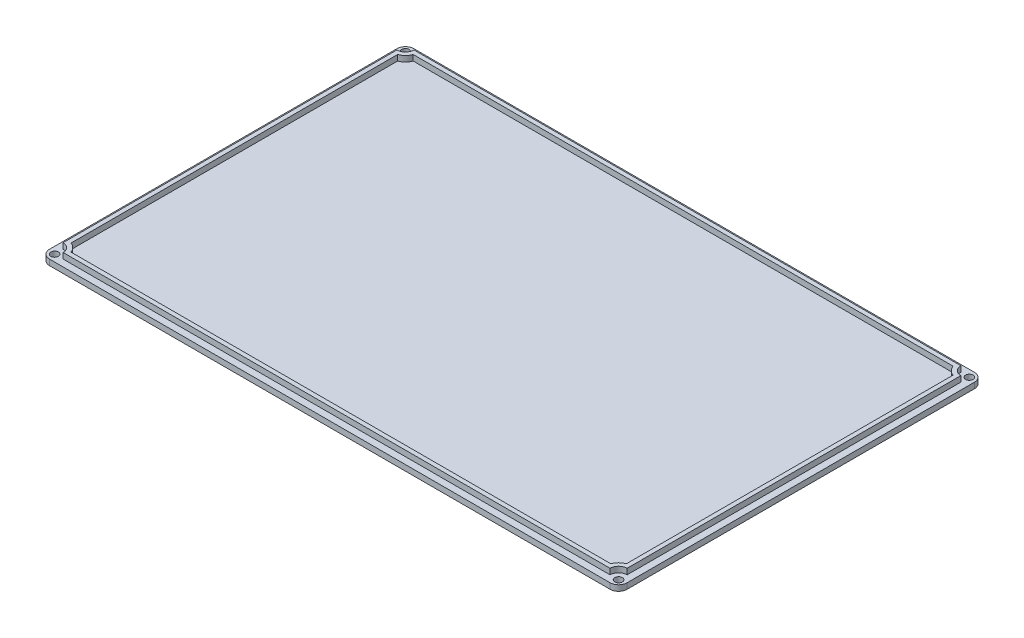
ISO-10303-21;
HEADER;
FILE_DESCRIPTION(('STEP AP214'),'2;1');
FILE_NAME('part.step','',(''),(''),'','','');
FILE_SCHEMA(('AUTOMOTIVE_DESIGN { 1 0 10303 214 1 1 1 1 }'));
ENDSEC;
DATA;
#1=APPLICATION_CONTEXT('core data for automotive mechanical design processes');
#2=APPLICATION_PROTOCOL_DEFINITION('international standard','automotive_design',2000,#1);
#3=PRODUCT_CONTEXT('',#1,'mechanical');
#4=PRODUCT('Part','Part','',(#3));
#5=PRODUCT_RELATED_PRODUCT_CATEGORY('part','',(#4));
#6=PRODUCT_DEFINITION_FORMATION('','',#4);
#7=PRODUCT_DEFINITION_CONTEXT('part definition',#1,'design');
#8=PRODUCT_DEFINITION('design','',#6,#7);
#9=PRODUCT_DEFINITION_SHAPE('','',#8);
#10=(LENGTH_UNIT() NAMED_UNIT(*) SI_UNIT(.MILLI.,.METRE.));
#11=(NAMED_UNIT(*) PLANE_ANGLE_UNIT() SI_UNIT($,.RADIAN.));
#12=(NAMED_UNIT(*) SI_UNIT($,.STERADIAN.) SOLID_ANGLE_UNIT());
#13=UNCERTAINTY_MEASURE_WITH_UNIT(LENGTH_MEASURE(1.E-05),#10,'distance_accuracy_value','');
#14=(GEOMETRIC_REPRESENTATION_CONTEXT(3) GLOBAL_UNCERTAINTY_ASSIGNED_CONTEXT((#13)) GLOBAL_UNIT_ASSIGNED_CONTEXT((#10,
#11,#12)) REPRESENTATION_CONTEXT('',''));
#15=CARTESIAN_POINT('',(0.,0.,0.));
#16=DIRECTION('',(0.,0.,1.));
#17=DIRECTION('',(1.,0.,0.));
#18=AXIS2_PLACEMENT_3D('',#15,#16,#17);
#19=CARTESIAN_POINT('',(-2.,-1.699999902,-128.3359932));
#20=DIRECTION('',(0.,0.,1.));
#21=DIRECTION('',(1.,0.,0.));
#22=AXIS2_PLACEMENT_3D('',#19,#20,#21);
#23=PLANE('',#22);
#24=DIRECTION('',(1.,0.,0.));
#25=VECTOR('',#24,1.);
#26=CARTESIAN_POINT('',(-2.,-1.699999902,-128.3359932));
#27=LINE('',#26,#25);
#28=CARTESIAN_POINT('',(0.54,-1.699999902,-128.3359932));
#29=VERTEX_POINT('',#28);
#30=CARTESIAN_POINT('',(167.5159932,-1.699999902,-128.3359932));
#31=VERTEX_POINT('',#30);
#32=EDGE_CURVE('E451',#29,#31,#27,.T.);
#33=ORIENTED_EDGE('',*,*,#32,.F.);
#34=DIRECTION('',(0.,1.,0.));
#35=VECTOR('',#34,1.);
#36=CARTESIAN_POINT('',(0.54,0.,-128.3359932));
#37=LINE('',#36,#35);
#38=CARTESIAN_POINT('',(0.54,0.,-128.3359932));
#39=VERTEX_POINT('',#38);
#40=EDGE_CURVE('E519',#29,#39,#37,.T.);
#41=ORIENTED_EDGE('',*,*,#40,.T.);
#42=DIRECTION('',(1.,0.,0.));
#43=VECTOR('',#42,1.);
#44=CARTESIAN_POINT('',(-2.,0.,-128.3359932));
#45=LINE('',#44,#43);
#46=CARTESIAN_POINT('',(167.5159932,0.,-128.3359932));
#47=VERTEX_POINT('',#46);
#48=EDGE_CURVE('E426',#39,#47,#45,.T.);
#49=ORIENTED_EDGE('',*,*,#48,.T.);
#50=DIRECTION('',(0.,1.,0.));
#51=VECTOR('',#50,1.);
#52=CARTESIAN_POINT('',(167.5159932,-1.699999902,-128.3359932));
#53=LINE('',#52,#51);
#54=EDGE_CURVE('E516',#47,#31,#53,.F.);
#55=ORIENTED_EDGE('',*,*,#54,.T.);
#56=EDGE_LOOP('',(#33,#41,#49,#55));
#57=FACE_BOUND('',#56,.T.);
#58=ADVANCED_FACE('F101',(#57),#23,.F.);
#59=CARTESIAN_POINT('',(170.0559932,-1.699999902,-128.3359932));
#60=DIRECTION('',(-1.,0.,0.));
#61=DIRECTION('',(0.,0.,1.));
#62=AXIS2_PLACEMENT_3D('',#59,#60,#61);
#63=PLANE('',#62);
#64=DIRECTION('',(0.,0.,1.));
#65=VECTOR('',#64,1.);
#66=CARTESIAN_POINT('',(170.0559932,-1.699999902,-128.3359932));
#67=LINE('',#66,#65);
#68=CARTESIAN_POINT('',(170.0559932,-1.699999902,-125.7959932));
#69=VERTEX_POINT('',#68);
#70=CARTESIAN_POINT('',(170.0559932,-1.699999902,-22.32));
#71=VERTEX_POINT('',#70);
#72=EDGE_CURVE('E454',#69,#71,#67,.T.);
#73=ORIENTED_EDGE('',*,*,#72,.F.);
#74=DIRECTION('',(0.,1.,0.));
#75=VECTOR('',#74,1.);
#76=CARTESIAN_POINT('',(170.0559932,-1.699999902,-125.7959932));
#77=LINE('',#76,#75);
#78=CARTESIAN_POINT('',(170.0559932,0.,-125.7959932));
#79=VERTEX_POINT('',#78);
#80=EDGE_CURVE('E12',#69,#79,#77,.T.);
#81=ORIENTED_EDGE('',*,*,#80,.T.);
#82=DIRECTION('',(0.,0.,1.));
#83=VECTOR('',#82,1.);
#84=CARTESIAN_POINT('',(170.0559932,0.,-128.3359932));
#85=LINE('',#84,#83);
#86=CARTESIAN_POINT('',(170.0559932,0.,-22.32));
#87=VERTEX_POINT('',#86);
#88=EDGE_CURVE('E470',#79,#87,#85,.T.);
#89=ORIENTED_EDGE('',*,*,#88,.T.);
#90=DIRECTION('',(0.,1.,0.));
#91=VECTOR('',#90,1.);
#92=CARTESIAN_POINT('',(170.0559932,-1.699999902,-22.32));
#93=LINE('',#92,#91);
#94=EDGE_CURVE('E110',#87,#71,#93,.F.);
#95=ORIENTED_EDGE('',*,*,#94,.T.);
#96=EDGE_LOOP('',(#73,#81,#89,#95));
#97=FACE_BOUND('',#96,.T.);
#98=ADVANCED_FACE('F537',(#97),#63,.F.);
#99=CARTESIAN_POINT('',(-1.99999999999999,-1.699999902,-19.78));
#100=DIRECTION('',(0.,0.,1.));
#101=DIRECTION('',(1.,0.,0.));
#102=AXIS2_PLACEMENT_3D('',#99,#100,#101);
#103=PLANE('',#102);
#104=DIRECTION('',(1.,0.,0.));
#105=VECTOR('',#104,1.);
#106=CARTESIAN_POINT('',(-1.99999999999999,0.,-19.78));
#107=LINE('',#106,#105);
#108=CARTESIAN_POINT('',(0.540000000000008,0.,-19.78));
#109=VERTEX_POINT('',#108);
#110=CARTESIAN_POINT('',(167.5159932,0.,-19.78));
#111=VERTEX_POINT('',#110);
#112=EDGE_CURVE('E473',#109,#111,#107,.T.);
#113=ORIENTED_EDGE('',*,*,#112,.F.);
#114=DIRECTION('',(0.,1.,0.));
#115=VECTOR('',#114,1.);
#116=CARTESIAN_POINT('',(0.540000000000008,-1.699999902,-19.78));
#117=LINE('',#116,#115);
#118=CARTESIAN_POINT('',(0.540000000000008,-1.699999902,-19.78));
#119=VERTEX_POINT('',#118);
#120=EDGE_CURVE('E502',#109,#119,#117,.F.);
#121=ORIENTED_EDGE('',*,*,#120,.T.);
#122=DIRECTION('',(1.,0.,0.));
#123=VECTOR('',#122,1.);
#124=CARTESIAN_POINT('',(-1.99999999999999,-1.699999902,-19.78));
#125=LINE('',#124,#123);
#126=CARTESIAN_POINT('',(167.5159932,-1.699999902,-19.78));
#127=VERTEX_POINT('',#126);
#128=EDGE_CURVE('E458',#119,#127,#125,.T.);
#129=ORIENTED_EDGE('',*,*,#128,.T.);
#130=DIRECTION('',(0.,1.,0.));
#131=VECTOR('',#130,1.);
#132=CARTESIAN_POINT('',(167.5159932,0.,-19.78));
#133=LINE('',#132,#131);
#134=EDGE_CURVE('E498',#127,#111,#133,.T.);
#135=ORIENTED_EDGE('',*,*,#134,.T.);
#136=EDGE_LOOP('',(#113,#121,#129,#135));
#137=FACE_BOUND('',#136,.T.);
#138=ADVANCED_FACE('F545',(#137),#103,.T.);
#139=CARTESIAN_POINT('',(-2.,-1.699999902,-128.3359932));
#140=DIRECTION('',(-1.,0.,0.));
#141=DIRECTION('',(0.,0.,1.));
#142=AXIS2_PLACEMENT_3D('',#139,#140,#141);
#143=PLANE('',#142);
#144=DIRECTION('',(0.,0.,1.));
#145=VECTOR('',#144,1.);
#146=CARTESIAN_POINT('',(-2.,-1.699999902,-128.3359932));
#147=LINE('',#146,#145);
#148=CARTESIAN_POINT('',(-2.,-1.699999902,-125.7959932));
#149=VERTEX_POINT('',#148);
#150=CARTESIAN_POINT('',(-1.99999999999999,-1.699999902,-22.32));
#151=VERTEX_POINT('',#150);
#152=EDGE_CURVE('E462',#149,#151,#147,.T.);
#153=ORIENTED_EDGE('',*,*,#152,.T.);
#154=DIRECTION('',(0.,1.,0.));
#155=VECTOR('',#154,1.);
#156=CARTESIAN_POINT('',(-1.99999999999999,-1.699999902,-22.32));
#157=LINE('',#156,#155);
#158=CARTESIAN_POINT('',(-1.99999999999999,0.,-22.32));
#159=VERTEX_POINT('',#158);
#160=EDGE_CURVE('E482',#151,#159,#157,.T.);
#161=ORIENTED_EDGE('',*,*,#160,.T.);
#162=DIRECTION('',(0.,0.,1.));
#163=VECTOR('',#162,1.);
#164=CARTESIAN_POINT('',(-2.,0.,-128.3359932));
#165=LINE('',#164,#163);
#166=CARTESIAN_POINT('',(-2.,0.,-125.7959932));
#167=VERTEX_POINT('',#166);
#168=EDGE_CURVE('E455',#167,#159,#165,.T.);
#169=ORIENTED_EDGE('',*,*,#168,.F.);
#170=DIRECTION('',(0.,1.,0.));
#171=VECTOR('',#170,1.);
#172=CARTESIAN_POINT('',(-2.,-1.699999902,-125.7959932));
#173=LINE('',#172,#171);
#174=EDGE_CURVE('E466',#167,#149,#173,.F.);
#175=ORIENTED_EDGE('',*,*,#174,.T.);
#176=EDGE_LOOP('',(#153,#161,#169,#175));
#177=FACE_BOUND('',#176,.T.);
#178=ADVANCED_FACE('F552',(#177),#143,.T.);
#179=CARTESIAN_POINT('',(0.,-1.699999902,0.));
#180=DIRECTION('',(0.,-1.,0.));
#181=DIRECTION('',(0.,0.,-1.));
#182=AXIS2_PLACEMENT_3D('',#179,#180,#181);
#183=PLANE('',#182);
#184=CARTESIAN_POINT('',(0.0319999999997152,-1.699999902,-21.8119999999997));
#185=DIRECTION('',(0.,1.,0.));
#186=DIRECTION('',(0.,0.,1.));
#187=AXIS2_PLACEMENT_3D('',#184,#185,#186);
#188=CIRCLE('',#187,1.1303);
#189=CARTESIAN_POINT('',(0.0319999999997152,-1.699999902,-20.6816999999997));
#190=VERTEX_POINT('',#189);
#191=EDGE_CURVE('E664',#190,#190,#188,.T.);
#192=ORIENTED_EDGE('',*,*,#191,.T.);
#193=EDGE_LOOP('',(#192));
#194=FACE_BOUND('',#193,.T.);
#195=CARTESIAN_POINT('',(168.0239932,-1.699999902,-21.812));
#196=DIRECTION('',(0.,1.,0.));
#197=DIRECTION('',(0.,0.,1.));
#198=AXIS2_PLACEMENT_3D('',#195,#196,#197);
#199=CIRCLE('',#198,1.1303);
#200=CARTESIAN_POINT('',(168.0239932,-1.699999902,-20.6817));
#201=VERTEX_POINT('',#200);
#202=EDGE_CURVE('E677',#201,#201,#199,.T.);
#203=ORIENTED_EDGE('',*,*,#202,.T.);
#204=EDGE_LOOP('',(#203));
#205=FACE_BOUND('',#204,.T.);
#206=CARTESIAN_POINT('',(168.0239932,-1.699999902,-126.3039932));
#207=DIRECTION('',(0.,1.,0.));
#208=DIRECTION('',(0.,0.,1.));
#209=AXIS2_PLACEMENT_3D('',#206,#207,#208);
#210=CIRCLE('',#209,1.1303);
#211=CARTESIAN_POINT('',(168.0239932,-1.699999902,-125.1736932));
#212=VERTEX_POINT('',#211);
#213=EDGE_CURVE('E685',#212,#212,#210,.T.);
#214=ORIENTED_EDGE('',*,*,#213,.T.);
#215=EDGE_LOOP('',(#214));
#216=FACE_BOUND('',#215,.T.);
#217=CARTESIAN_POINT('',(0.0319999999999856,-1.699999902,-126.3039932));
#218=DIRECTION('',(0.,1.,0.));
#219=DIRECTION('',(0.,0.,1.));
#220=AXIS2_PLACEMENT_3D('',#217,#218,#219);
#221=CIRCLE('',#220,1.1303);
#222=CARTESIAN_POINT('',(0.0319999999999856,-1.699999902,-125.1736932));
#223=VERTEX_POINT('',#222);
#224=EDGE_CURVE('E299',#223,#223,#221,.T.);
#225=ORIENTED_EDGE('',*,*,#224,.T.);
#226=EDGE_LOOP('',(#225));
#227=FACE_BOUND('',#226,.T.);
#228=ORIENTED_EDGE('',*,*,#128,.F.);
#229=CARTESIAN_POINT('',(0.540000000000009,-1.699999902,-22.32));
#230=DIRECTION('',(0.,-1.,0.));
#231=DIRECTION('',(0.,0.,-1.));
#232=AXIS2_PLACEMENT_3D('',#229,#230,#231);
#233=CIRCLE('',#232,2.54);
#234=EDGE_CURVE('E513',#119,#151,#233,.T.);
#235=ORIENTED_EDGE('',*,*,#234,.T.);
#236=ORIENTED_EDGE('',*,*,#152,.F.);
#237=CARTESIAN_POINT('',(0.54,-1.699999902,-125.7959932));
#238=DIRECTION('',(0.,-1.,0.));
#239=DIRECTION('',(0.,0.,-1.));
#240=AXIS2_PLACEMENT_3D('',#237,#238,#239);
#241=CIRCLE('',#240,2.54);
#242=EDGE_CURVE('E510',#149,#29,#241,.T.);
#243=ORIENTED_EDGE('',*,*,#242,.T.);
#244=ORIENTED_EDGE('',*,*,#32,.T.);
#245=CARTESIAN_POINT('',(167.5159932,-1.699999902,-125.7959932));
#246=DIRECTION('',(0.,-1.,0.));
#247=DIRECTION('',(0.,0.,-1.));
#248=AXIS2_PLACEMENT_3D('',#245,#246,#247);
#249=CIRCLE('',#248,2.54);
#250=EDGE_CURVE('E123',#31,#69,#249,.T.);
#251=ORIENTED_EDGE('',*,*,#250,.T.);
#252=ORIENTED_EDGE('',*,*,#72,.T.);
#253=CARTESIAN_POINT('',(167.5159932,-1.699999902,-22.32));
#254=DIRECTION('',(0.,-1.,0.));
#255=DIRECTION('',(0.,0.,-1.));
#256=AXIS2_PLACEMENT_3D('',#253,#254,#255);
#257=CIRCLE('',#256,2.54);
#258=EDGE_CURVE('E505',#71,#127,#257,.T.);
#259=ORIENTED_EDGE('',*,*,#258,.T.);
#260=EDGE_LOOP('',(#228,#235,#236,#243,#244,#251,#252,#259));
#261=FACE_BOUND('',#260,.T.);
#262=ADVANCED_FACE('F540',(#194,#205,#216,#227,#261),#183,.T.);
#263=CARTESIAN_POINT('',(0.,0.,0.));
#264=DIRECTION('',(0.,-1.,0.));
#265=DIRECTION('',(0.,0.,-1.));
#266=AXIS2_PLACEMENT_3D('',#263,#264,#265);
#267=PLANE('',#266);
#268=CARTESIAN_POINT('',(0.0319999999997152,0.,-21.8119999999997));
#269=DIRECTION('',(0.,1.,0.));
#270=DIRECTION('',(0.,0.,1.));
#271=AXIS2_PLACEMENT_3D('',#268,#269,#270);
#272=CIRCLE('',#271,1.1303);
#273=CARTESIAN_POINT('',(0.0319999999997152,0.,-20.6816999999997));
#274=VERTEX_POINT('',#273);
#275=EDGE_CURVE('E667',#274,#274,#272,.T.);
#276=ORIENTED_EDGE('',*,*,#275,.F.);
#277=EDGE_LOOP('',(#276));
#278=FACE_BOUND('',#277,.T.);
#279=CARTESIAN_POINT('',(168.0239932,0.,-21.812));
#280=DIRECTION('',(0.,1.,0.));
#281=DIRECTION('',(0.,0.,1.));
#282=AXIS2_PLACEMENT_3D('',#279,#280,#281);
#283=CIRCLE('',#282,1.1303);
#284=CARTESIAN_POINT('',(168.0239932,0.,-20.6817));
#285=VERTEX_POINT('',#284);
#286=EDGE_CURVE('E671',#285,#285,#283,.T.);
#287=ORIENTED_EDGE('',*,*,#286,.F.);
#288=EDGE_LOOP('',(#287));
#289=FACE_BOUND('',#288,.T.);
#290=CARTESIAN_POINT('',(168.0239932,0.,-126.3039932));
#291=DIRECTION('',(0.,1.,0.));
#292=DIRECTION('',(0.,0.,1.));
#293=AXIS2_PLACEMENT_3D('',#290,#291,#292);
#294=CIRCLE('',#293,1.1303);
#295=CARTESIAN_POINT('',(168.0239932,0.,-125.1736932));
#296=VERTEX_POINT('',#295);
#297=EDGE_CURVE('E681',#296,#296,#294,.T.);
#298=ORIENTED_EDGE('',*,*,#297,.F.);
#299=EDGE_LOOP('',(#298));
#300=FACE_BOUND('',#299,.T.);
#301=CARTESIAN_POINT('',(0.0319999999999856,0.,-126.3039932));
#302=DIRECTION('',(0.,1.,0.));
#303=DIRECTION('',(0.,0.,1.));
#304=AXIS2_PLACEMENT_3D('',#301,#302,#303);
#305=CIRCLE('',#304,1.1303);
#306=CARTESIAN_POINT('',(0.0319999999999856,0.,-125.1736932));
#307=VERTEX_POINT('',#306);
#308=EDGE_CURVE('E688',#307,#307,#305,.T.);
#309=ORIENTED_EDGE('',*,*,#308,.F.);
#310=EDGE_LOOP('',(#309));
#311=FACE_BOUND('',#310,.T.);
#312=DIRECTION('',(0.,0.,1.));
#313=VECTOR('',#312,1.);
#314=CARTESIAN_POINT('',(0.0319999999999951,0.,-123.7639932));
#315=LINE('',#314,#313);
#316=CARTESIAN_POINT('',(0.0319999999999951,0.,-123.7639932));
#317=VERTEX_POINT('',#316);
#318=CARTESIAN_POINT('',(0.0320000000000081,0.,-24.352));
#319=VERTEX_POINT('',#318);
#320=EDGE_CURVE('E371',#317,#319,#315,.T.);
#321=ORIENTED_EDGE('',*,*,#320,.F.);
#322=CARTESIAN_POINT('',(0.0319999999999856,0.,-126.3039932));
#323=DIRECTION('',(0.,1.,0.));
#324=DIRECTION('',(0.,0.,1.));
#325=AXIS2_PLACEMENT_3D('',#322,#323,#324);
#326=CIRCLE('',#325,2.54000000000001);
#327=CARTESIAN_POINT('',(2.572,0.,-126.3039932));
#328=VERTEX_POINT('',#327);
#329=EDGE_CURVE('E343',#317,#328,#326,.T.);
#330=ORIENTED_EDGE('',*,*,#329,.T.);
#331=DIRECTION('',(1.,0.,0.));
#332=VECTOR('',#331,1.);
#333=CARTESIAN_POINT('',(2.572,0.,-126.3039932));
#334=LINE('',#333,#332);
#335=CARTESIAN_POINT('',(165.4839932,0.,-126.3039932));
#336=VERTEX_POINT('',#335);
#337=EDGE_CURVE('E399',#328,#336,#334,.T.);
#338=ORIENTED_EDGE('',*,*,#337,.T.);
#339=CARTESIAN_POINT('',(168.0239932,0.,-126.3039932));
#340=DIRECTION('',(0.,1.,0.));
#341=DIRECTION('',(0.,0.,1.));
#342=AXIS2_PLACEMENT_3D('',#339,#340,#341);
#343=CIRCLE('',#342,2.53999999999999);
#344=CARTESIAN_POINT('',(168.0239932,0.,-123.7639932));
#345=VERTEX_POINT('',#344);
#346=EDGE_CURVE('E403',#336,#345,#343,.T.);
#347=ORIENTED_EDGE('',*,*,#346,.T.);
#348=DIRECTION('',(0.,0.,1.));
#349=VECTOR('',#348,1.);
#350=CARTESIAN_POINT('',(168.0239932,0.,-123.7639932));
#351=LINE('',#350,#349);
#352=CARTESIAN_POINT('',(168.0239932,0.,-24.352));
#353=VERTEX_POINT('',#352);
#354=EDGE_CURVE('E407',#345,#353,#351,.T.);
#355=ORIENTED_EDGE('',*,*,#354,.T.);
#356=CARTESIAN_POINT('',(168.0239932,0.,-21.812));
#357=DIRECTION('',(0.,-1.,0.));
#358=DIRECTION('',(0.,0.,-1.));
#359=AXIS2_PLACEMENT_3D('',#356,#357,#358);
#360=CIRCLE('',#359,2.53999999999999);
#361=CARTESIAN_POINT('',(165.4839932,0.,-21.812));
#362=VERTEX_POINT('',#361);
#363=EDGE_CURVE('E411',#362,#353,#360,.T.);
#364=ORIENTED_EDGE('',*,*,#363,.F.);
#365=DIRECTION('',(1.,0.,0.));
#366=VECTOR('',#365,1.);
#367=CARTESIAN_POINT('',(2.57200000000001,0.,-21.812));
#368=LINE('',#367,#366);
#369=CARTESIAN_POINT('',(2.57200000000001,0.,-21.812));
#370=VERTEX_POINT('',#369);
#371=EDGE_CURVE('E415',#370,#362,#368,.T.);
#372=ORIENTED_EDGE('',*,*,#371,.F.);
#373=CARTESIAN_POINT('',(0.0319999999997152,0.,-21.8119999999997));
#374=DIRECTION('',(0.,-1.,0.));
#375=DIRECTION('',(0.,0.,-1.));
#376=AXIS2_PLACEMENT_3D('',#373,#374,#375);
#377=CIRCLE('',#376,2.54000000000029);
#378=EDGE_CURVE('E418',#319,#370,#377,.T.);
#379=ORIENTED_EDGE('',*,*,#378,.F.);
#380=EDGE_LOOP('',(#321,#330,#338,#347,#355,#364,#372,#379));
#381=FACE_BOUND('',#380,.T.);
#382=ORIENTED_EDGE('',*,*,#168,.T.);
#383=CARTESIAN_POINT('',(0.540000000000009,0.,-22.32));
#384=DIRECTION('',(0.,-1.,0.));
#385=DIRECTION('',(0.,0.,-1.));
#386=AXIS2_PLACEMENT_3D('',#383,#384,#385);
#387=CIRCLE('',#386,2.54);
#388=EDGE_CURVE('E495',#159,#109,#387,.F.);
#389=ORIENTED_EDGE('',*,*,#388,.T.);
#390=ORIENTED_EDGE('',*,*,#112,.T.);
#391=CARTESIAN_POINT('',(167.5159932,0.,-22.32));
#392=DIRECTION('',(0.,-1.,0.));
#393=DIRECTION('',(0.,0.,-1.));
#394=AXIS2_PLACEMENT_3D('',#391,#392,#393);
#395=CIRCLE('',#394,2.54);
#396=EDGE_CURVE('E486',#111,#87,#395,.F.);
#397=ORIENTED_EDGE('',*,*,#396,.T.);
#398=ORIENTED_EDGE('',*,*,#88,.F.);
#399=CARTESIAN_POINT('',(167.5159932,0.,-125.7959932));
#400=DIRECTION('',(0.,-1.,0.));
#401=DIRECTION('',(0.,0.,-1.));
#402=AXIS2_PLACEMENT_3D('',#399,#400,#401);
#403=CIRCLE('',#402,2.54);
#404=EDGE_CURVE('E489',#79,#47,#403,.F.);
#405=ORIENTED_EDGE('',*,*,#404,.T.);
#406=ORIENTED_EDGE('',*,*,#48,.F.);
#407=CARTESIAN_POINT('',(0.54,0.,-125.7959932));
#408=DIRECTION('',(0.,-1.,0.));
#409=DIRECTION('',(0.,0.,-1.));
#410=AXIS2_PLACEMENT_3D('',#407,#408,#409);
#411=CIRCLE('',#410,2.54);
#412=EDGE_CURVE('E492',#39,#167,#411,.F.);
#413=ORIENTED_EDGE('',*,*,#412,.T.);
#414=EDGE_LOOP('',(#382,#389,#390,#397,#398,#405,#406,#413));
#415=FACE_BOUND('',#414,.T.);
#416=ADVANCED_FACE('F531',(#278,#289,#300,#311,#381,#415),#267,.F.);
#417=CARTESIAN_POINT('',(0.0319999999999856,1.7,-126.3039932));
#418=DIRECTION('',(0.,-1.,0.));
#419=DIRECTION('',(0.,0.,-1.));
#420=AXIS2_PLACEMENT_3D('',#417,#418,#419);
#421=CYLINDRICAL_SURFACE('',#420,2.54000000000001);
#422=ORIENTED_EDGE('',*,*,#329,.F.);
#423=DIRECTION('',(0.,-1.,0.));
#424=VECTOR('',#423,1.);
#425=CARTESIAN_POINT('',(0.0319999999999951,1.7,-123.7639932));
#426=LINE('',#425,#424);
#427=CARTESIAN_POINT('',(0.0319999999999951,1.7,-123.7639932));
#428=VERTEX_POINT('',#427);
#429=EDGE_CURVE('E423',#428,#317,#426,.T.);
#430=ORIENTED_EDGE('',*,*,#429,.F.);
#431=CARTESIAN_POINT('',(0.0319999999999856,1.7,-126.3039932));
#432=DIRECTION('',(0.,1.,0.));
#433=DIRECTION('',(0.,0.,1.));
#434=AXIS2_PLACEMENT_3D('',#431,#432,#433);
#435=CIRCLE('',#434,2.54000000000001);
#436=CARTESIAN_POINT('',(2.572,1.7,-126.3039932));
#437=VERTEX_POINT('',#436);
#438=EDGE_CURVE('E366',#428,#437,#435,.T.);
#439=ORIENTED_EDGE('',*,*,#438,.T.);
#440=DIRECTION('',(0.,-1.,0.));
#441=VECTOR('',#440,1.);
#442=CARTESIAN_POINT('',(2.572,1.7,-126.3039932));
#443=LINE('',#442,#441);
#444=EDGE_CURVE('E395',#437,#328,#443,.T.);
#445=ORIENTED_EDGE('',*,*,#444,.T.);
#446=EDGE_LOOP('',(#422,#430,#439,#445));
#447=FACE_BOUND('',#446,.T.);
#448=ADVANCED_FACE('F578',(#447),#421,.F.);
#449=CARTESIAN_POINT('',(0.0319999999999951,1.7,-123.7639932));
#450=DIRECTION('',(1.,0.,0.));
#451=DIRECTION('',(0.,0.,-1.));
#452=AXIS2_PLACEMENT_3D('',#449,#450,#451);
#453=PLANE('',#452);
#454=ORIENTED_EDGE('',*,*,#320,.T.);
#455=DIRECTION('',(0.,-1.,0.));
#456=VECTOR('',#455,1.);
#457=CARTESIAN_POINT('',(0.0320000000000081,1.7,-24.352));
#458=LINE('',#457,#456);
#459=CARTESIAN_POINT('',(0.0320000000000081,1.7,-24.352));
#460=VERTEX_POINT('',#459);
#461=EDGE_CURVE('E427',#460,#319,#458,.T.);
#462=ORIENTED_EDGE('',*,*,#461,.F.);
#463=DIRECTION('',(0.,0.,1.));
#464=VECTOR('',#463,1.);
#465=CARTESIAN_POINT('',(0.0319999999999951,1.7,-123.7639932));
#466=LINE('',#465,#464);
#467=EDGE_CURVE('E392',#428,#460,#466,.T.);
#468=ORIENTED_EDGE('',*,*,#467,.F.);
#469=ORIENTED_EDGE('',*,*,#429,.T.);
#470=EDGE_LOOP('',(#454,#462,#468,#469));
#471=FACE_BOUND('',#470,.T.);
#472=ADVANCED_FACE('F585',(#471),#453,.F.);
#473=CARTESIAN_POINT('',(0.0319999999997152,1.7,-21.8119999999997));
#474=DIRECTION('',(0.,-1.,0.));
#475=DIRECTION('',(0.,0.,-1.));
#476=AXIS2_PLACEMENT_3D('',#473,#474,#475);
#477=CYLINDRICAL_SURFACE('',#476,2.54000000000029);
#478=ORIENTED_EDGE('',*,*,#378,.T.);
#479=DIRECTION('',(0.,-1.,0.));
#480=VECTOR('',#479,1.);
#481=CARTESIAN_POINT('',(2.57200000000001,1.7,-21.812));
#482=LINE('',#481,#480);
#483=CARTESIAN_POINT('',(2.57200000000001,1.7,-21.812));
#484=VERTEX_POINT('',#483);
#485=EDGE_CURVE('E431',#484,#370,#482,.T.);
#486=ORIENTED_EDGE('',*,*,#485,.F.);
#487=CARTESIAN_POINT('',(0.0319999999997152,1.7,-21.8119999999997));
#488=DIRECTION('',(0.,-1.,0.));
#489=DIRECTION('',(0.,0.,-1.));
#490=AXIS2_PLACEMENT_3D('',#487,#488,#489);
#491=CIRCLE('',#490,2.54000000000029);
#492=EDGE_CURVE('E389',#460,#484,#491,.T.);
#493=ORIENTED_EDGE('',*,*,#492,.F.);
#494=ORIENTED_EDGE('',*,*,#461,.T.);
#495=EDGE_LOOP('',(#478,#486,#493,#494));
#496=FACE_BOUND('',#495,.T.);
#497=ADVANCED_FACE('F606',(#496),#477,.F.);
#498=CARTESIAN_POINT('',(2.57200000000001,1.7,-21.812));
#499=DIRECTION('',(0.,0.,-1.));
#500=DIRECTION('',(-1.,0.,0.));
#501=AXIS2_PLACEMENT_3D('',#498,#499,#500);
#502=PLANE('',#501);
#503=ORIENTED_EDGE('',*,*,#371,.T.);
#504=DIRECTION('',(0.,-1.,0.));
#505=VECTOR('',#504,1.);
#506=CARTESIAN_POINT('',(165.4839932,1.7,-21.812));
#507=LINE('',#506,#505);
#508=CARTESIAN_POINT('',(165.4839932,1.7,-21.812));
#509=VERTEX_POINT('',#508);
#510=EDGE_CURVE('E435',#509,#362,#507,.T.);
#511=ORIENTED_EDGE('',*,*,#510,.F.);
#512=DIRECTION('',(1.,0.,0.));
#513=VECTOR('',#512,1.);
#514=CARTESIAN_POINT('',(2.57200000000001,1.7,-21.812));
#515=LINE('',#514,#513);
#516=EDGE_CURVE('E386',#484,#509,#515,.T.);
#517=ORIENTED_EDGE('',*,*,#516,.F.);
#518=ORIENTED_EDGE('',*,*,#485,.T.);
#519=EDGE_LOOP('',(#503,#511,#517,#518));
#520=FACE_BOUND('',#519,.T.);
#521=ADVANCED_FACE('F602',(#520),#502,.F.);
#522=CARTESIAN_POINT('',(168.0239932,1.7,-21.812));
#523=DIRECTION('',(0.,-1.,0.));
#524=DIRECTION('',(0.,0.,-1.));
#525=AXIS2_PLACEMENT_3D('',#522,#523,#524);
#526=CYLINDRICAL_SURFACE('',#525,2.53999999999999);
#527=ORIENTED_EDGE('',*,*,#363,.T.);
#528=DIRECTION('',(0.,-1.,0.));
#529=VECTOR('',#528,1.);
#530=CARTESIAN_POINT('',(168.0239932,1.7,-24.352));
#531=LINE('',#530,#529);
#532=CARTESIAN_POINT('',(168.0239932,1.7,-24.352));
#533=VERTEX_POINT('',#532);
#534=EDGE_CURVE('E439',#533,#353,#531,.T.);
#535=ORIENTED_EDGE('',*,*,#534,.F.);
#536=CARTESIAN_POINT('',(168.0239932,1.7,-21.812));
#537=DIRECTION('',(0.,-1.,0.));
#538=DIRECTION('',(0.,0.,-1.));
#539=AXIS2_PLACEMENT_3D('',#536,#537,#538);
#540=CIRCLE('',#539,2.53999999999999);
#541=EDGE_CURVE('E383',#509,#533,#540,.T.);
#542=ORIENTED_EDGE('',*,*,#541,.F.);
#543=ORIENTED_EDGE('',*,*,#510,.T.);
#544=EDGE_LOOP('',(#527,#535,#542,#543));
#545=FACE_BOUND('',#544,.T.);
#546=ADVANCED_FACE('F598',(#545),#526,.F.);
#547=CARTESIAN_POINT('',(168.0239932,1.7,-123.7639932));
#548=DIRECTION('',(1.,0.,0.));
#549=DIRECTION('',(0.,0.,-1.));
#550=AXIS2_PLACEMENT_3D('',#547,#548,#549);
#551=PLANE('',#550);
#552=ORIENTED_EDGE('',*,*,#354,.F.);
#553=DIRECTION('',(0.,-1.,0.));
#554=VECTOR('',#553,1.);
#555=CARTESIAN_POINT('',(168.0239932,1.7,-123.7639932));
#556=LINE('',#555,#554);
#557=CARTESIAN_POINT('',(168.0239932,1.7,-123.7639932));
#558=VERTEX_POINT('',#557);
#559=EDGE_CURVE('E442',#558,#345,#556,.T.);
#560=ORIENTED_EDGE('',*,*,#559,.F.);
#561=DIRECTION('',(0.,0.,1.));
#562=VECTOR('',#561,1.);
#563=CARTESIAN_POINT('',(168.0239932,1.7,-123.7639932));
#564=LINE('',#563,#562);
#565=EDGE_CURVE('E379',#558,#533,#564,.T.);
#566=ORIENTED_EDGE('',*,*,#565,.T.);
#567=ORIENTED_EDGE('',*,*,#534,.T.);
#568=EDGE_LOOP('',(#552,#560,#566,#567));
#569=FACE_BOUND('',#568,.T.);
#570=ADVANCED_FACE('F594',(#569),#551,.T.);
#571=CARTESIAN_POINT('',(168.0239932,1.7,-126.3039932));
#572=DIRECTION('',(0.,-1.,0.));
#573=DIRECTION('',(0.,0.,-1.));
#574=AXIS2_PLACEMENT_3D('',#571,#572,#573);
#575=CYLINDRICAL_SURFACE('',#574,2.53999999999999);
#576=ORIENTED_EDGE('',*,*,#346,.F.);
#577=DIRECTION('',(0.,-1.,0.));
#578=VECTOR('',#577,1.);
#579=CARTESIAN_POINT('',(165.4839932,1.7,-126.3039932));
#580=LINE('',#579,#578);
#581=CARTESIAN_POINT('',(165.4839932,1.7,-126.3039932));
#582=VERTEX_POINT('',#581);
#583=EDGE_CURVE('E445',#582,#336,#580,.T.);
#584=ORIENTED_EDGE('',*,*,#583,.F.);
#585=CARTESIAN_POINT('',(168.0239932,1.7,-126.3039932));
#586=DIRECTION('',(0.,1.,0.));
#587=DIRECTION('',(0.,0.,1.));
#588=AXIS2_PLACEMENT_3D('',#585,#586,#587);
#589=CIRCLE('',#588,2.53999999999999);
#590=EDGE_CURVE('E375',#582,#558,#589,.T.);
#591=ORIENTED_EDGE('',*,*,#590,.T.);
#592=ORIENTED_EDGE('',*,*,#559,.T.);
#593=EDGE_LOOP('',(#576,#584,#591,#592));
#594=FACE_BOUND('',#593,.T.);
#595=ADVANCED_FACE('F590',(#594),#575,.F.);
#596=CARTESIAN_POINT('',(2.572,1.7,-126.3039932));
#597=DIRECTION('',(0.,0.,-1.));
#598=DIRECTION('',(-1.,0.,0.));
#599=AXIS2_PLACEMENT_3D('',#596,#597,#598);
#600=PLANE('',#599);
#601=ORIENTED_EDGE('',*,*,#337,.F.);
#602=ORIENTED_EDGE('',*,*,#444,.F.);
#603=DIRECTION('',(1.,0.,0.));
#604=VECTOR('',#603,1.);
#605=CARTESIAN_POINT('',(2.572,1.7,-126.3039932));
#606=LINE('',#605,#604);
#607=EDGE_CURVE('E370',#437,#582,#606,.T.);
#608=ORIENTED_EDGE('',*,*,#607,.T.);
#609=ORIENTED_EDGE('',*,*,#583,.T.);
#610=EDGE_LOOP('',(#601,#602,#608,#609));
#611=FACE_BOUND('',#610,.T.);
#612=ADVANCED_FACE('F587',(#611),#600,.T.);
#613=CARTESIAN_POINT('',(0.0319999999999856,1.7,-126.3039932));
#614=DIRECTION('',(0.,1.,0.));
#615=DIRECTION('',(0.,0.,1.));
#616=AXIS2_PLACEMENT_3D('',#613,#614,#615);
#617=PLANE('',#616);
#618=CARTESIAN_POINT('',(0.0319999999999947,1.7,-126.3039932));
#619=DIRECTION('',(0.,1.,0.));
#620=DIRECTION('',(0.,0.,1.));
#621=AXIS2_PLACEMENT_3D('',#618,#619,#620);
#622=CIRCLE('',#621,3.81);
#623=CARTESIAN_POINT('',(1.302,1.7,-122.711890751572));
#624=VERTEX_POINT('',#623);
#625=CARTESIAN_POINT('',(3.62410244842766,1.7,-125.0339932));
#626=VERTEX_POINT('',#625);
#627=EDGE_CURVE('E270',#624,#626,#622,.T.);
#628=ORIENTED_EDGE('',*,*,#627,.T.);
#629=DIRECTION('',(1.,0.,0.));
#630=VECTOR('',#629,1.);
#631=CARTESIAN_POINT('',(3.62410244842766,1.7,-125.0339932));
#632=LINE('',#631,#630);
#633=CARTESIAN_POINT('',(164.431890751572,1.7,-125.0339932));
#634=VERTEX_POINT('',#633);
#635=EDGE_CURVE('E281',#626,#634,#632,.T.);
#636=ORIENTED_EDGE('',*,*,#635,.T.);
#637=CARTESIAN_POINT('',(168.0239932,1.7,-126.3039932));
#638=DIRECTION('',(0.,1.,0.));
#639=DIRECTION('',(0.,0.,1.));
#640=AXIS2_PLACEMENT_3D('',#637,#638,#639);
#641=CIRCLE('',#640,3.80999999999999);
#642=CARTESIAN_POINT('',(166.7539932,1.7,-122.711890751572));
#643=VERTEX_POINT('',#642);
#644=EDGE_CURVE('E287',#634,#643,#641,.T.);
#645=ORIENTED_EDGE('',*,*,#644,.T.);
#646=DIRECTION('',(0.,0.,1.));
#647=VECTOR('',#646,1.);
#648=CARTESIAN_POINT('',(166.7539932,1.7,-122.711890751572));
#649=LINE('',#648,#647);
#650=CARTESIAN_POINT('',(166.7539932,1.7,-25.4041024484277));
#651=VERTEX_POINT('',#650);
#652=EDGE_CURVE('E304',#643,#651,#649,.T.);
#653=ORIENTED_EDGE('',*,*,#652,.T.);
#654=CARTESIAN_POINT('',(168.0239932,1.7,-21.812));
#655=DIRECTION('',(0.,-1.,0.));
#656=DIRECTION('',(0.,0.,-1.));
#657=AXIS2_PLACEMENT_3D('',#654,#655,#656);
#658=CIRCLE('',#657,3.81000000000002);
#659=CARTESIAN_POINT('',(164.431890751572,1.7,-23.082));
#660=VERTEX_POINT('',#659);
#661=EDGE_CURVE('E308',#660,#651,#658,.T.);
#662=ORIENTED_EDGE('',*,*,#661,.F.);
#663=DIRECTION('',(1.,0.,0.));
#664=VECTOR('',#663,1.);
#665=CARTESIAN_POINT('',(3.62410244842767,1.7,-23.082));
#666=LINE('',#665,#664);
#667=CARTESIAN_POINT('',(3.62410244842767,1.7,-23.082));
#668=VERTEX_POINT('',#667);
#669=EDGE_CURVE('E311',#668,#660,#666,.T.);
#670=ORIENTED_EDGE('',*,*,#669,.F.);
#671=CARTESIAN_POINT('',(0.0320000000000086,1.7,-21.812));
#672=DIRECTION('',(0.,-1.,0.));
#673=DIRECTION('',(0.,0.,-1.));
#674=AXIS2_PLACEMENT_3D('',#671,#672,#673);
#675=CIRCLE('',#674,3.81);
#676=CARTESIAN_POINT('',(1.30200000000001,1.7,-25.4041024484277));
#677=VERTEX_POINT('',#676);
#678=EDGE_CURVE('E314',#677,#668,#675,.T.);
#679=ORIENTED_EDGE('',*,*,#678,.F.);
#680=DIRECTION('',(0.,0.,1.));
#681=VECTOR('',#680,1.);
#682=CARTESIAN_POINT('',(1.302,1.7,-122.711890751572));
#683=LINE('',#682,#681);
#684=EDGE_CURVE('E277',#624,#677,#683,.T.);
#685=ORIENTED_EDGE('',*,*,#684,.F.);
#686=EDGE_LOOP('',(#628,#636,#645,#653,#662,#670,#679,#685));
#687=FACE_BOUND('',#686,.T.);
#688=ORIENTED_EDGE('',*,*,#438,.F.);
#689=ORIENTED_EDGE('',*,*,#467,.T.);
#690=ORIENTED_EDGE('',*,*,#492,.T.);
#691=ORIENTED_EDGE('',*,*,#516,.T.);
#692=ORIENTED_EDGE('',*,*,#541,.T.);
#693=ORIENTED_EDGE('',*,*,#565,.F.);
#694=ORIENTED_EDGE('',*,*,#590,.F.);
#695=ORIENTED_EDGE('',*,*,#607,.F.);
#696=EDGE_LOOP('',(#688,#689,#690,#691,#692,#693,#694,#695));
#697=FACE_BOUND('',#696,.T.);
#698=ADVANCED_FACE('F289',(#687,#697),#617,.T.);
#699=CARTESIAN_POINT('',(0.0319999999999947,1.7,-126.3039932));
#700=DIRECTION('',(0.,-1.,0.));
#701=DIRECTION('',(0.,0.,-1.));
#702=AXIS2_PLACEMENT_3D('',#699,#700,#701);
#703=CYLINDRICAL_SURFACE('',#702,3.81);
#704=CARTESIAN_POINT('',(0.0319999999999947,0.,-126.3039932));
#705=DIRECTION('',(0.,1.,0.));
#706=DIRECTION('',(0.,0.,1.));
#707=AXIS2_PLACEMENT_3D('',#704,#705,#706);
#708=CIRCLE('',#707,3.81);
#709=CARTESIAN_POINT('',(1.302,0.,-122.711890751572));
#710=VERTEX_POINT('',#709);
#711=CARTESIAN_POINT('',(3.62410244842766,0.,-125.0339932));
#712=VERTEX_POINT('',#711);
#713=EDGE_CURVE('E272',#710,#712,#708,.T.);
#714=ORIENTED_EDGE('',*,*,#713,.T.);
#715=DIRECTION('',(0.,-1.,0.));
#716=VECTOR('',#715,1.);
#717=CARTESIAN_POINT('',(3.62410244842766,1.7,-125.0339932));
#718=LINE('',#717,#716);
#719=EDGE_CURVE('E265',#626,#712,#718,.T.);
#720=ORIENTED_EDGE('',*,*,#719,.F.);
#721=ORIENTED_EDGE('',*,*,#627,.F.);
#722=DIRECTION('',(0.,-1.,0.));
#723=VECTOR('',#722,1.);
#724=CARTESIAN_POINT('',(1.302,1.7,-122.711890751572));
#725=LINE('',#724,#723);
#726=EDGE_CURVE('E340',#624,#710,#725,.T.);
#727=ORIENTED_EDGE('',*,*,#726,.T.);
#728=EDGE_LOOP('',(#714,#720,#721,#727));
#729=FACE_BOUND('',#728,.T.);
#730=ADVANCED_FACE('F267',(#729),#703,.T.);
#731=CARTESIAN_POINT('',(1.302,1.7,-122.711890751572));
#732=DIRECTION('',(1.,0.,0.));
#733=DIRECTION('',(0.,0.,-1.));
#734=AXIS2_PLACEMENT_3D('',#731,#732,#733);
#735=PLANE('',#734);
#736=DIRECTION('',(0.,0.,1.));
#737=VECTOR('',#736,1.);
#738=CARTESIAN_POINT('',(1.302,0.,-122.711890751572));
#739=LINE('',#738,#737);
#740=CARTESIAN_POINT('',(1.30200000000001,0.,-25.4041024484277));
#741=VERTEX_POINT('',#740);
#742=EDGE_CURVE('E293',#710,#741,#739,.T.);
#743=ORIENTED_EDGE('',*,*,#742,.F.);
#744=ORIENTED_EDGE('',*,*,#726,.F.);
#745=ORIENTED_EDGE('',*,*,#684,.T.);
#746=DIRECTION('',(0.,-1.,0.));
#747=VECTOR('',#746,1.);
#748=CARTESIAN_POINT('',(1.30200000000001,1.7,-25.4041024484277));
#749=LINE('',#748,#747);
#750=EDGE_CURVE('E344',#677,#741,#749,.T.);
#751=ORIENTED_EDGE('',*,*,#750,.T.);
#752=EDGE_LOOP('',(#743,#744,#745,#751));
#753=FACE_BOUND('',#752,.T.);
#754=ADVANCED_FACE('F618',(#753),#735,.T.);
#755=CARTESIAN_POINT('',(0.0320000000000086,1.7,-21.812));
#756=DIRECTION('',(0.,-1.,0.));
#757=DIRECTION('',(0.,0.,-1.));
#758=AXIS2_PLACEMENT_3D('',#755,#756,#757);
#759=CYLINDRICAL_SURFACE('',#758,3.81);
#760=CARTESIAN_POINT('',(0.0320000000000086,0.,-21.812));
#761=DIRECTION('',(0.,-1.,0.));
#762=DIRECTION('',(0.,0.,-1.));
#763=AXIS2_PLACEMENT_3D('',#760,#761,#762);
#764=CIRCLE('',#763,3.81);
#765=CARTESIAN_POINT('',(3.62410244842767,0.,-23.082));
#766=VERTEX_POINT('',#765);
#767=EDGE_CURVE('E296',#741,#766,#764,.T.);
#768=ORIENTED_EDGE('',*,*,#767,.F.);
#769=ORIENTED_EDGE('',*,*,#750,.F.);
#770=ORIENTED_EDGE('',*,*,#678,.T.);
#771=DIRECTION('',(0.,-1.,0.));
#772=VECTOR('',#771,1.);
#773=CARTESIAN_POINT('',(3.62410244842767,1.7,-23.082));
#774=LINE('',#773,#772);
#775=EDGE_CURVE('E348',#668,#766,#774,.T.);
#776=ORIENTED_EDGE('',*,*,#775,.T.);
#777=EDGE_LOOP('',(#768,#769,#770,#776));
#778=FACE_BOUND('',#777,.T.);
#779=ADVANCED_FACE('F636',(#778),#759,.T.);
#780=CARTESIAN_POINT('',(3.62410244842767,1.7,-23.082));
#781=DIRECTION('',(0.,0.,-1.));
#782=DIRECTION('',(-1.,0.,0.));
#783=AXIS2_PLACEMENT_3D('',#780,#781,#782);
#784=PLANE('',#783);
#785=DIRECTION('',(1.,0.,0.));
#786=VECTOR('',#785,1.);
#787=CARTESIAN_POINT('',(3.62410244842767,0.,-23.082));
#788=LINE('',#787,#786);
#789=CARTESIAN_POINT('',(164.431890751572,0.,-23.082));
#790=VERTEX_POINT('',#789);
#791=EDGE_CURVE('E335',#766,#790,#788,.T.);
#792=ORIENTED_EDGE('',*,*,#791,.F.);
#793=ORIENTED_EDGE('',*,*,#775,.F.);
#794=ORIENTED_EDGE('',*,*,#669,.T.);
#795=DIRECTION('',(0.,-1.,0.));
#796=VECTOR('',#795,1.);
#797=CARTESIAN_POINT('',(164.431890751572,1.7,-23.082));
#798=LINE('',#797,#796);
#799=EDGE_CURVE('E352',#660,#790,#798,.T.);
#800=ORIENTED_EDGE('',*,*,#799,.T.);
#801=EDGE_LOOP('',(#792,#793,#794,#800));
#802=FACE_BOUND('',#801,.T.);
#803=ADVANCED_FACE('F632',(#802),#784,.T.);
#804=CARTESIAN_POINT('',(168.0239932,1.7,-21.812));
#805=DIRECTION('',(0.,-1.,0.));
#806=DIRECTION('',(0.,0.,-1.));
#807=AXIS2_PLACEMENT_3D('',#804,#805,#806);
#808=CYLINDRICAL_SURFACE('',#807,3.81000000000002);
#809=CARTESIAN_POINT('',(168.0239932,0.,-21.812));
#810=DIRECTION('',(0.,-1.,0.));
#811=DIRECTION('',(0.,0.,-1.));
#812=AXIS2_PLACEMENT_3D('',#809,#810,#811);
#813=CIRCLE('',#812,3.81000000000002);
#814=CARTESIAN_POINT('',(166.7539932,0.,-25.4041024484277));
#815=VERTEX_POINT('',#814);
#816=EDGE_CURVE('E332',#790,#815,#813,.T.);
#817=ORIENTED_EDGE('',*,*,#816,.F.);
#818=ORIENTED_EDGE('',*,*,#799,.F.);
#819=ORIENTED_EDGE('',*,*,#661,.T.);
#820=DIRECTION('',(0.,-1.,0.));
#821=VECTOR('',#820,1.);
#822=CARTESIAN_POINT('',(166.7539932,1.7,-25.4041024484277));
#823=LINE('',#822,#821);
#824=EDGE_CURVE('E356',#651,#815,#823,.T.);
#825=ORIENTED_EDGE('',*,*,#824,.T.);
#826=EDGE_LOOP('',(#817,#818,#819,#825));
#827=FACE_BOUND('',#826,.T.);
#828=ADVANCED_FACE('F628',(#827),#808,.T.);
#829=CARTESIAN_POINT('',(166.7539932,1.7,-122.711890751572));
#830=DIRECTION('',(1.,0.,0.));
#831=DIRECTION('',(0.,0.,-1.));
#832=AXIS2_PLACEMENT_3D('',#829,#830,#831);
#833=PLANE('',#832);
#834=DIRECTION('',(0.,0.,1.));
#835=VECTOR('',#834,1.);
#836=CARTESIAN_POINT('',(166.7539932,0.,-122.711890751572));
#837=LINE('',#836,#835);
#838=CARTESIAN_POINT('',(166.7539932,0.,-122.711890751572));
#839=VERTEX_POINT('',#838);
#840=EDGE_CURVE('E328',#839,#815,#837,.T.);
#841=ORIENTED_EDGE('',*,*,#840,.T.);
#842=ORIENTED_EDGE('',*,*,#824,.F.);
#843=ORIENTED_EDGE('',*,*,#652,.F.);
#844=DIRECTION('',(0.,-1.,0.));
#845=VECTOR('',#844,1.);
#846=CARTESIAN_POINT('',(166.7539932,1.7,-122.711890751572));
#847=LINE('',#846,#845);
#848=EDGE_CURVE('E360',#643,#839,#847,.T.);
#849=ORIENTED_EDGE('',*,*,#848,.T.);
#850=EDGE_LOOP('',(#841,#842,#843,#849));
#851=FACE_BOUND('',#850,.T.);
#852=ADVANCED_FACE('F624',(#851),#833,.F.);
#853=CARTESIAN_POINT('',(168.0239932,1.7,-126.3039932));
#854=DIRECTION('',(0.,-1.,0.));
#855=DIRECTION('',(0.,0.,-1.));
#856=AXIS2_PLACEMENT_3D('',#853,#854,#855);
#857=CYLINDRICAL_SURFACE('',#856,3.80999999999999);
#858=CARTESIAN_POINT('',(168.0239932,0.,-126.3039932));
#859=DIRECTION('',(0.,1.,0.));
#860=DIRECTION('',(0.,0.,1.));
#861=AXIS2_PLACEMENT_3D('',#858,#859,#860);
#862=CIRCLE('',#861,3.80999999999999);
#863=CARTESIAN_POINT('',(164.431890751572,0.,-125.0339932));
#864=VERTEX_POINT('',#863);
#865=EDGE_CURVE('E324',#864,#839,#862,.T.);
#866=ORIENTED_EDGE('',*,*,#865,.T.);
#867=ORIENTED_EDGE('',*,*,#848,.F.);
#868=ORIENTED_EDGE('',*,*,#644,.F.);
#869=DIRECTION('',(0.,-1.,0.));
#870=VECTOR('',#869,1.);
#871=CARTESIAN_POINT('',(164.431890751572,1.7,-125.0339932));
#872=LINE('',#871,#870);
#873=EDGE_CURVE('E276',#634,#864,#872,.T.);
#874=ORIENTED_EDGE('',*,*,#873,.T.);
#875=EDGE_LOOP('',(#866,#867,#868,#874));
#876=FACE_BOUND('',#875,.T.);
#877=ADVANCED_FACE('F621',(#876),#857,.T.);
#878=CARTESIAN_POINT('',(3.62410244842766,1.7,-125.0339932));
#879=DIRECTION('',(0.,0.,-1.));
#880=DIRECTION('',(-1.,0.,0.));
#881=AXIS2_PLACEMENT_3D('',#878,#879,#880);
#882=PLANE('',#881);
#883=DIRECTION('',(1.,0.,0.));
#884=VECTOR('',#883,1.);
#885=CARTESIAN_POINT('',(3.62410244842766,0.,-125.0339932));
#886=LINE('',#885,#884);
#887=EDGE_CURVE('E321',#712,#864,#886,.T.);
#888=ORIENTED_EDGE('',*,*,#887,.T.);
#889=ORIENTED_EDGE('',*,*,#873,.F.);
#890=ORIENTED_EDGE('',*,*,#635,.F.);
#891=ORIENTED_EDGE('',*,*,#719,.T.);
#892=EDGE_LOOP('',(#888,#889,#890,#891));
#893=FACE_BOUND('',#892,.T.);
#894=ADVANCED_FACE('F282',(#893),#882,.F.);
#895=ORIENTED_EDGE('',*,*,#713,.F.);
#896=ORIENTED_EDGE('',*,*,#742,.T.);
#897=ORIENTED_EDGE('',*,*,#767,.T.);
#898=ORIENTED_EDGE('',*,*,#791,.T.);
#899=ORIENTED_EDGE('',*,*,#816,.T.);
#900=ORIENTED_EDGE('',*,*,#840,.F.);
#901=ORIENTED_EDGE('',*,*,#865,.F.);
#902=ORIENTED_EDGE('',*,*,#887,.F.);
#903=EDGE_LOOP('',(#895,#896,#897,#898,#899,#900,#901,#902));
#904=FACE_BOUND('',#903,.T.);
#905=ADVANCED_FACE('F562',(#904),#267,.F.);
#906=CARTESIAN_POINT('',(0.540000000000009,-1.699999902,-22.32));
#907=DIRECTION('',(0.,1.,0.));
#908=DIRECTION('',(0.,0.,1.));
#909=AXIS2_PLACEMENT_3D('',#906,#907,#908);
#910=CYLINDRICAL_SURFACE('',#909,2.54);
#911=ORIENTED_EDGE('',*,*,#234,.F.);
#912=ORIENTED_EDGE('',*,*,#120,.F.);
#913=ORIENTED_EDGE('',*,*,#388,.F.);
#914=ORIENTED_EDGE('',*,*,#160,.F.);
#915=EDGE_LOOP('',(#911,#912,#913,#914));
#916=FACE_BOUND('',#915,.T.);
#917=ADVANCED_FACE('F550',(#916),#910,.T.);
#918=CARTESIAN_POINT('',(0.54,-1.699999902,-125.7959932));
#919=DIRECTION('',(0.,-1.,0.));
#920=DIRECTION('',(0.,0.,-1.));
#921=AXIS2_PLACEMENT_3D('',#918,#919,#920);
#922=CYLINDRICAL_SURFACE('',#921,2.54);
#923=ORIENTED_EDGE('',*,*,#242,.F.);
#924=ORIENTED_EDGE('',*,*,#174,.F.);
#925=ORIENTED_EDGE('',*,*,#412,.F.);
#926=ORIENTED_EDGE('',*,*,#40,.F.);
#927=EDGE_LOOP('',(#923,#924,#925,#926));
#928=FACE_BOUND('',#927,.T.);
#929=ADVANCED_FACE('F555',(#928),#922,.T.);
#930=CARTESIAN_POINT('',(167.5159932,-1.699999902,-125.7959932));
#931=DIRECTION('',(0.,1.,0.));
#932=DIRECTION('',(0.,0.,1.));
#933=AXIS2_PLACEMENT_3D('',#930,#931,#932);
#934=CYLINDRICAL_SURFACE('',#933,2.54);
#935=ORIENTED_EDGE('',*,*,#250,.F.);
#936=ORIENTED_EDGE('',*,*,#54,.F.);
#937=ORIENTED_EDGE('',*,*,#404,.F.);
#938=ORIENTED_EDGE('',*,*,#80,.F.);
#939=EDGE_LOOP('',(#935,#936,#937,#938));
#940=FACE_BOUND('',#939,.T.);
#941=ADVANCED_FACE('F536',(#940),#934,.T.);
#942=CARTESIAN_POINT('',(167.5159932,-1.699999902,-22.32));
#943=DIRECTION('',(0.,-1.,0.));
#944=DIRECTION('',(0.,0.,-1.));
#945=AXIS2_PLACEMENT_3D('',#942,#943,#944);
#946=CYLINDRICAL_SURFACE('',#945,2.54);
#947=ORIENTED_EDGE('',*,*,#258,.F.);
#948=ORIENTED_EDGE('',*,*,#94,.F.);
#949=ORIENTED_EDGE('',*,*,#396,.F.);
#950=ORIENTED_EDGE('',*,*,#134,.F.);
#951=EDGE_LOOP('',(#947,#948,#949,#950));
#952=FACE_BOUND('',#951,.T.);
#953=ADVANCED_FACE('F103',(#952),#946,.T.);
#954=CARTESIAN_POINT('',(0.0319999999999856,0.,-126.3039932));
#955=DIRECTION('',(0.,1.,0.));
#956=DIRECTION('',(0.,0.,1.));
#957=AXIS2_PLACEMENT_3D('',#954,#955,#956);
#958=CYLINDRICAL_SURFACE('',#957,1.1303);
#959=ORIENTED_EDGE('',*,*,#224,.F.);
#960=EDGE_LOOP('',(#959));
#961=FACE_BOUND('',#960,.T.);
#962=ORIENTED_EDGE('',*,*,#308,.T.);
#963=EDGE_LOOP('',(#962));
#964=FACE_BOUND('',#963,.T.);
#965=ADVANCED_FACE('F644',(#961,#964),#958,.F.);
#966=CARTESIAN_POINT('',(168.0239932,0.,-126.3039932));
#967=DIRECTION('',(0.,1.,0.));
#968=DIRECTION('',(0.,0.,1.));
#969=AXIS2_PLACEMENT_3D('',#966,#967,#968);
#970=CYLINDRICAL_SURFACE('',#969,1.1303);
#971=ORIENTED_EDGE('',*,*,#213,.F.);
#972=EDGE_LOOP('',(#971));
#973=FACE_BOUND('',#972,.T.);
#974=ORIENTED_EDGE('',*,*,#297,.T.);
#975=EDGE_LOOP('',(#974));
#976=FACE_BOUND('',#975,.T.);
#977=ADVANCED_FACE('F647',(#973,#976),#970,.F.);
#978=CARTESIAN_POINT('',(168.0239932,0.,-21.812));
#979=DIRECTION('',(0.,1.,0.));
#980=DIRECTION('',(0.,0.,1.));
#981=AXIS2_PLACEMENT_3D('',#978,#979,#980);
#982=CYLINDRICAL_SURFACE('',#981,1.1303);
#983=ORIENTED_EDGE('',*,*,#202,.F.);
#984=EDGE_LOOP('',(#983));
#985=FACE_BOUND('',#984,.T.);
#986=ORIENTED_EDGE('',*,*,#286,.T.);
#987=EDGE_LOOP('',(#986));
#988=FACE_BOUND('',#987,.T.);
#989=ADVANCED_FACE('F651',(#985,#988),#982,.F.);
#990=CARTESIAN_POINT('',(0.0319999999997152,0.,-21.8119999999997));
#991=DIRECTION('',(0.,1.,0.));
#992=DIRECTION('',(0.,0.,1.));
#993=AXIS2_PLACEMENT_3D('',#990,#991,#992);
#994=CYLINDRICAL_SURFACE('',#993,1.1303);
#995=ORIENTED_EDGE('',*,*,#191,.F.);
#996=EDGE_LOOP('',(#995));
#997=FACE_BOUND('',#996,.T.);
#998=ORIENTED_EDGE('',*,*,#275,.T.);
#999=EDGE_LOOP('',(#998));
#1000=FACE_BOUND('',#999,.T.);
#1001=ADVANCED_FACE('F655',(#997,#1000),#994,.F.);
#1002=CLOSED_SHELL('',(#58,#98,#138,#178,#262,#416,#448,#472,#497,#521,#546,#570,#595,#612,#698,
#730,#754,#779,#803,#828,#852,#877,#894,#905,#917,#929,#941,#953,#965,#977,#989,#1001));
#1003=MANIFOLD_SOLID_BREP('B2',#1002);
#1004=ADVANCED_BREP_SHAPE_REPRESENTATION('',(#18,#1003),#14);
#1005=SHAPE_DEFINITION_REPRESENTATION(#9,#1004);
ENDSEC;
END-ISO-10303-21;
